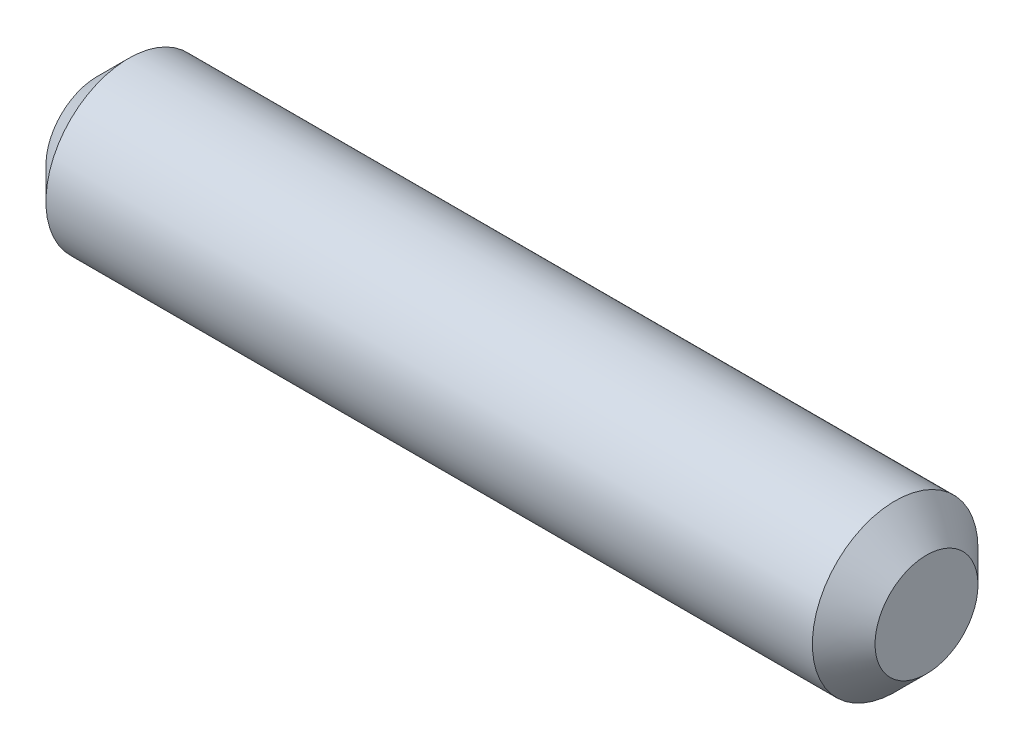
ISO-10303-21;
HEADER;
FILE_DESCRIPTION(('STEP AP214'),'2;1');
FILE_NAME('part.step','',(''),(''),'','','');
FILE_SCHEMA(('AUTOMOTIVE_DESIGN { 1 0 10303 214 1 1 1 1 }'));
ENDSEC;
DATA;
#1=APPLICATION_CONTEXT('core data for automotive mechanical design processes');
#2=APPLICATION_PROTOCOL_DEFINITION('international standard','automotive_design',2000,#1);
#3=PRODUCT_CONTEXT('',#1,'mechanical');
#4=PRODUCT('Part','Part','',(#3));
#5=PRODUCT_RELATED_PRODUCT_CATEGORY('part','',(#4));
#6=PRODUCT_DEFINITION_FORMATION('','',#4);
#7=PRODUCT_DEFINITION_CONTEXT('part definition',#1,'design');
#8=PRODUCT_DEFINITION('design','',#6,#7);
#9=PRODUCT_DEFINITION_SHAPE('','',#8);
#10=(LENGTH_UNIT() NAMED_UNIT(*) SI_UNIT(.MILLI.,.METRE.));
#11=(NAMED_UNIT(*) PLANE_ANGLE_UNIT() SI_UNIT($,.RADIAN.));
#12=(NAMED_UNIT(*) SI_UNIT($,.STERADIAN.) SOLID_ANGLE_UNIT());
#13=UNCERTAINTY_MEASURE_WITH_UNIT(LENGTH_MEASURE(1.E-05),#10,'distance_accuracy_value','');
#14=(GEOMETRIC_REPRESENTATION_CONTEXT(3) GLOBAL_UNCERTAINTY_ASSIGNED_CONTEXT((#13)) GLOBAL_UNIT_ASSIGNED_CONTEXT((#10,
#11,#12)) REPRESENTATION_CONTEXT('',''));
#15=CARTESIAN_POINT('',(0.,0.,0.));
#16=DIRECTION('',(0.,0.,1.));
#17=DIRECTION('',(1.,0.,0.));
#18=AXIS2_PLACEMENT_3D('',#15,#16,#17);
#19=CARTESIAN_POINT('',(7.935,0.,0.));
#20=DIRECTION('',(-1.,0.,0.));
#21=DIRECTION('',(0.,0.,1.));
#22=AXIS2_PLACEMENT_3D('',#19,#20,#21);
#23=CYLINDRICAL_SURFACE('',#22,1.585);
#24=CARTESIAN_POINT('',(-7.335,0.,0.));
#25=DIRECTION('',(1.,0.,0.));
#26=DIRECTION('',(0.,0.,-1.));
#27=AXIS2_PLACEMENT_3D('',#24,#25,#26);
#28=CIRCLE('',#27,1.585);
#29=CARTESIAN_POINT('',(-7.335,0.,-1.585));
#30=VERTEX_POINT('',#29);
#31=EDGE_CURVE('E53',#30,#30,#28,.T.);
#32=ORIENTED_EDGE('',*,*,#31,.T.);
#33=EDGE_LOOP('',(#32));
#34=FACE_BOUND('',#33,.T.);
#35=CARTESIAN_POINT('',(7.335,0.,0.));
#36=DIRECTION('',(1.,0.,0.));
#37=DIRECTION('',(0.,0.,-1.));
#38=AXIS2_PLACEMENT_3D('',#35,#36,#37);
#39=CIRCLE('',#38,1.585);
#40=CARTESIAN_POINT('',(7.335,0.,-1.585));
#41=VERTEX_POINT('',#40);
#42=EDGE_CURVE('E58',#41,#41,#39,.F.);
#43=ORIENTED_EDGE('',*,*,#42,.T.);
#44=EDGE_LOOP('',(#43));
#45=FACE_BOUND('',#44,.T.);
#46=ADVANCED_FACE('F39',(#34,#45),#23,.T.);
#47=CARTESIAN_POINT('',(7.935,0.,0.));
#48=DIRECTION('',(1.,0.,0.));
#49=DIRECTION('',(0.,0.,-1.));
#50=AXIS2_PLACEMENT_3D('',#47,#48,#49);
#51=PLANE('',#50);
#52=CARTESIAN_POINT('',(7.935,0.,0.));
#53=DIRECTION('',(1.,0.,0.));
#54=DIRECTION('',(0.,0.,-1.));
#55=AXIS2_PLACEMENT_3D('',#52,#53,#54);
#56=CIRCLE('',#55,0.984999999999998);
#57=CARTESIAN_POINT('',(7.935,0.,-0.984999999999998));
#58=VERTEX_POINT('',#57);
#59=EDGE_CURVE('E10',#58,#58,#56,.T.);
#60=ORIENTED_EDGE('',*,*,#59,.T.);
#61=EDGE_LOOP('',(#60));
#62=FACE_BOUND('',#61,.T.);
#63=ADVANCED_FACE('F75',(#62),#51,.T.);
#64=CARTESIAN_POINT('',(-7.935,0.,0.));
#65=DIRECTION('',(1.,0.,0.));
#66=DIRECTION('',(0.,0.,-1.));
#67=AXIS2_PLACEMENT_3D('',#64,#65,#66);
#68=PLANE('',#67);
#69=CARTESIAN_POINT('',(-7.935,0.,0.));
#70=DIRECTION('',(1.,0.,0.));
#71=DIRECTION('',(0.,0.,-1.));
#72=AXIS2_PLACEMENT_3D('',#69,#70,#71);
#73=CIRCLE('',#72,0.984999999999998);
#74=CARTESIAN_POINT('',(-7.935,0.,-0.984999999999998));
#75=VERTEX_POINT('',#74);
#76=EDGE_CURVE('E48',#75,#75,#73,.F.);
#77=ORIENTED_EDGE('',*,*,#76,.T.);
#78=EDGE_LOOP('',(#77));
#79=FACE_BOUND('',#78,.T.);
#80=ADVANCED_FACE('F72',(#79),#68,.F.);
#81=CARTESIAN_POINT('',(-7.335,0.,0.));
#82=DIRECTION('',(1.,0.,0.));
#83=DIRECTION('',(0.,0.,-1.));
#84=AXIS2_PLACEMENT_3D('',#81,#82,#83);
#85=CONICAL_SURFACE('',#84,1.585,0.785398163397449);
#86=ORIENTED_EDGE('',*,*,#76,.F.);
#87=EDGE_LOOP('',(#86));
#88=FACE_BOUND('',#87,.T.);
#89=ORIENTED_EDGE('',*,*,#31,.F.);
#90=EDGE_LOOP('',(#89));
#91=FACE_BOUND('',#90,.T.);
#92=ADVANCED_FACE('F68',(#88,#91),#85,.T.);
#93=CARTESIAN_POINT('',(7.935,0.,0.));
#94=DIRECTION('',(-1.,0.,0.));
#95=DIRECTION('',(0.,0.,1.));
#96=AXIS2_PLACEMENT_3D('',#93,#94,#95);
#97=CONICAL_SURFACE('',#96,0.984999999999998,0.785398163397448);
#98=ORIENTED_EDGE('',*,*,#42,.F.);
#99=EDGE_LOOP('',(#98));
#100=FACE_BOUND('',#99,.T.);
#101=ORIENTED_EDGE('',*,*,#59,.F.);
#102=EDGE_LOOP('',(#101));
#103=FACE_BOUND('',#102,.T.);
#104=ADVANCED_FACE('F42',(#100,#103),#97,.T.);
#105=CLOSED_SHELL('',(#46,#63,#80,#92,#104));
#106=MANIFOLD_SOLID_BREP('B2',#105);
#107=ADVANCED_BREP_SHAPE_REPRESENTATION('',(#18,#106),#14);
#108=SHAPE_DEFINITION_REPRESENTATION(#9,#107);
ENDSEC;
END-ISO-10303-21;
